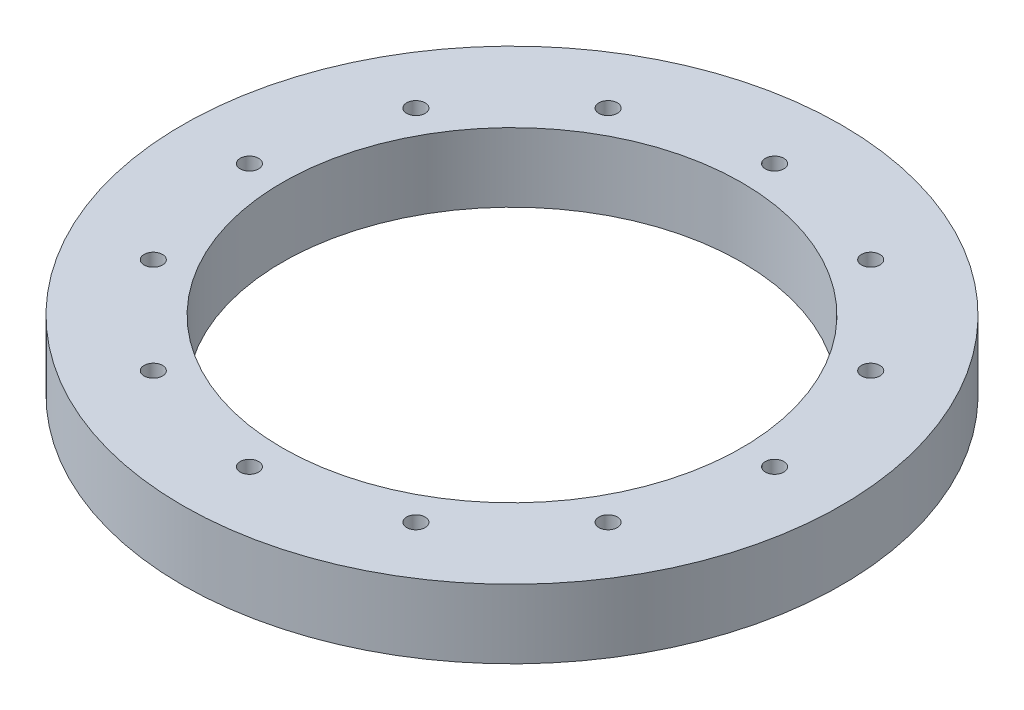
ISO-10303-21;
HEADER;
FILE_DESCRIPTION(('STEP AP214'),'2;1');
FILE_NAME('part.step','',(''),(''),'','','');
FILE_SCHEMA(('AUTOMOTIVE_DESIGN { 1 0 10303 214 1 1 1 1 }'));
ENDSEC;
DATA;
#1=APPLICATION_CONTEXT('core data for automotive mechanical design processes');
#2=APPLICATION_PROTOCOL_DEFINITION('international standard','automotive_design',2000,#1);
#3=PRODUCT_CONTEXT('',#1,'mechanical');
#4=PRODUCT('Part','Part','',(#3));
#5=PRODUCT_RELATED_PRODUCT_CATEGORY('part','',(#4));
#6=PRODUCT_DEFINITION_FORMATION('','',#4);
#7=PRODUCT_DEFINITION_CONTEXT('part definition',#1,'design');
#8=PRODUCT_DEFINITION('design','',#6,#7);
#9=PRODUCT_DEFINITION_SHAPE('','',#8);
#10=(LENGTH_UNIT() NAMED_UNIT(*) SI_UNIT(.MILLI.,.METRE.));
#11=(NAMED_UNIT(*) PLANE_ANGLE_UNIT() SI_UNIT($,.RADIAN.));
#12=(NAMED_UNIT(*) SI_UNIT($,.STERADIAN.) SOLID_ANGLE_UNIT());
#13=UNCERTAINTY_MEASURE_WITH_UNIT(LENGTH_MEASURE(1.E-05),#10,'distance_accuracy_value','');
#14=(GEOMETRIC_REPRESENTATION_CONTEXT(3) GLOBAL_UNCERTAINTY_ASSIGNED_CONTEXT((#13)) GLOBAL_UNIT_ASSIGNED_CONTEXT((#10,
#11,#12)) REPRESENTATION_CONTEXT('',''));
#15=CARTESIAN_POINT('',(0.,0.,0.));
#16=DIRECTION('',(0.,0.,1.));
#17=DIRECTION('',(1.,0.,0.));
#18=AXIS2_PLACEMENT_3D('',#15,#16,#17);
#19=CARTESIAN_POINT('',(0.,26.67,0.));
#20=DIRECTION('',(0.,1.,0.));
#21=DIRECTION('',(0.,0.,1.));
#22=AXIS2_PLACEMENT_3D('',#19,#20,#21);
#23=PLANE('',#22);
#24=CARTESIAN_POINT('',(-87.9881810244968,26.67,-50.7999999999962));
#25=DIRECTION('',(0.,1.,0.));
#26=DIRECTION('',(0.,0.,1.));
#27=AXIS2_PLACEMENT_3D('',#24,#25,#26);
#28=CIRCLE('',#27,3.56870000000436);
#29=CARTESIAN_POINT('',(-87.9881810244968,26.67,-47.2312999999918));
#30=VERTEX_POINT('',#29);
#31=EDGE_CURVE('E115',#30,#30,#28,.T.);
#32=ORIENTED_EDGE('',*,*,#31,.F.);
#33=EDGE_LOOP('',(#32));
#34=FACE_BOUND('',#33,.T.);
#35=CARTESIAN_POINT('',(-87.9881810244925,26.67,50.8000000000038));
#36=DIRECTION('',(0.,1.,0.));
#37=DIRECTION('',(0.,0.,1.));
#38=AXIS2_PLACEMENT_3D('',#35,#36,#37);
#39=CIRCLE('',#38,3.56870000000821);
#40=CARTESIAN_POINT('',(-87.9881810244925,26.67,54.368700000012));
#41=VERTEX_POINT('',#40);
#42=EDGE_CURVE('E103',#41,#41,#39,.T.);
#43=ORIENTED_EDGE('',*,*,#42,.F.);
#44=EDGE_LOOP('',(#43));
#45=FACE_BOUND('',#44,.T.);
#46=CARTESIAN_POINT('',(8.62560979994913E-12,26.67,101.6));
#47=DIRECTION('',(0.,1.,0.));
#48=DIRECTION('',(0.,0.,1.));
#49=AXIS2_PLACEMENT_3D('',#46,#47,#48);
#50=CIRCLE('',#49,3.56870000000893);
#51=CARTESIAN_POINT('',(8.62560979994913E-12,26.67,105.168700000009));
#52=VERTEX_POINT('',#51);
#53=EDGE_CURVE('E91',#52,#52,#50,.T.);
#54=ORIENTED_EDGE('',*,*,#53,.F.);
#55=EDGE_LOOP('',(#54));
#56=FACE_BOUND('',#55,.T.);
#57=CARTESIAN_POINT('',(87.9881810245054,26.67,50.7999999999963));
#58=DIRECTION('',(0.,1.,0.));
#59=DIRECTION('',(0.,0.,1.));
#60=AXIS2_PLACEMENT_3D('',#57,#58,#59);
#61=CIRCLE('',#60,3.56870000000556);
#62=CARTESIAN_POINT('',(87.9881810245054,26.67,54.3687000000018));
#63=VERTEX_POINT('',#62);
#64=EDGE_CURVE('E79',#63,#63,#61,.T.);
#65=ORIENTED_EDGE('',*,*,#64,.F.);
#66=EDGE_LOOP('',(#65));
#67=FACE_BOUND('',#66,.T.);
#68=CARTESIAN_POINT('',(87.9881810245011,26.67,-50.8000000000037));
#69=DIRECTION('',(0.,1.,0.));
#70=DIRECTION('',(0.,0.,1.));
#71=AXIS2_PLACEMENT_3D('',#68,#69,#70);
#72=CIRCLE('',#71,3.56870000000122);
#73=CARTESIAN_POINT('',(87.9881810245011,26.67,-47.2313000000025));
#74=VERTEX_POINT('',#73);
#75=EDGE_CURVE('E67',#74,#74,#72,.T.);
#76=ORIENTED_EDGE('',*,*,#75,.F.);
#77=EDGE_LOOP('',(#76));
#78=FACE_BOUND('',#77,.T.);
#79=CARTESIAN_POINT('',(0.,26.67,-101.6));
#80=DIRECTION('',(0.,1.,0.));
#81=DIRECTION('',(0.,0.,1.));
#82=AXIS2_PLACEMENT_3D('',#79,#80,#81);
#83=CIRCLE('',#82,3.5687);
#84=CARTESIAN_POINT('',(0.,26.67,-98.0313));
#85=VERTEX_POINT('',#84);
#86=EDGE_CURVE('E55',#85,#85,#83,.T.);
#87=ORIENTED_EDGE('',*,*,#86,.F.);
#88=EDGE_LOOP('',(#87));
#89=FACE_BOUND('',#88,.T.);
#90=CARTESIAN_POINT('',(0.,26.67,0.));
#91=DIRECTION('',(0.,1.,0.));
#92=DIRECTION('',(0.,0.,1.));
#93=AXIS2_PLACEMENT_3D('',#90,#91,#92);
#94=CIRCLE('',#93,127.508);
#95=CARTESIAN_POINT('',(0.,26.67,127.508));
#96=VERTEX_POINT('',#95);
#97=EDGE_CURVE('E10',#96,#96,#94,.T.);
#98=ORIENTED_EDGE('',*,*,#97,.T.);
#99=EDGE_LOOP('',(#98));
#100=FACE_BOUND('',#99,.T.);
#101=CARTESIAN_POINT('',(0.,26.67,0.));
#102=DIRECTION('',(0.,1.,0.));
#103=DIRECTION('',(0.,0.,1.));
#104=AXIS2_PLACEMENT_3D('',#101,#102,#103);
#105=CIRCLE('',#104,88.9);
#106=CARTESIAN_POINT('',(0.,26.67,88.9));
#107=VERTEX_POINT('',#106);
#108=EDGE_CURVE('E50',#107,#107,#105,.T.);
#109=ORIENTED_EDGE('',*,*,#108,.F.);
#110=EDGE_LOOP('',(#109));
#111=FACE_BOUND('',#110,.T.);
#112=CARTESIAN_POINT('',(50.8000000000001,26.67,-87.9881810244989));
#113=DIRECTION('',(0.,1.,0.));
#114=DIRECTION('',(0.,0.,1.));
#115=AXIS2_PLACEMENT_3D('',#112,#113,#114);
#116=CIRCLE('',#115,3.5687);
#117=CARTESIAN_POINT('',(50.8000000000001,26.67,-84.4194810244989));
#118=VERTEX_POINT('',#117);
#119=EDGE_CURVE('E61',#118,#118,#116,.T.);
#120=ORIENTED_EDGE('',*,*,#119,.F.);
#121=EDGE_LOOP('',(#120));
#122=FACE_BOUND('',#121,.T.);
#123=CARTESIAN_POINT('',(101.600000000004,26.67,-4.31280489997457E-12));
#124=DIRECTION('',(0.,1.,0.));
#125=DIRECTION('',(0.,0.,1.));
#126=AXIS2_PLACEMENT_3D('',#123,#124,#125);
#127=CIRCLE('',#126,3.56870000000321);
#128=CARTESIAN_POINT('',(101.600000000004,26.67,3.56869999999889));
#129=VERTEX_POINT('',#128);
#130=EDGE_CURVE('E73',#129,#129,#127,.T.);
#131=ORIENTED_EDGE('',*,*,#130,.F.);
#132=EDGE_LOOP('',(#131));
#133=FACE_BOUND('',#132,.T.);
#134=CARTESIAN_POINT('',(50.8000000000081,26.67,87.9881810244968));
#135=DIRECTION('',(0.,1.,0.));
#136=DIRECTION('',(0.,0.,1.));
#137=AXIS2_PLACEMENT_3D('',#134,#135,#136);
#138=CIRCLE('',#137,3.56870000000767);
#139=CARTESIAN_POINT('',(50.8000000000081,26.67,91.5568810245044));
#140=VERTEX_POINT('',#139);
#141=EDGE_CURVE('E85',#140,#140,#138,.T.);
#142=ORIENTED_EDGE('',*,*,#141,.F.);
#143=EDGE_LOOP('',(#142));
#144=FACE_BOUND('',#143,.T.);
#145=CARTESIAN_POINT('',(-50.7999999999919,26.67,87.9881810245011));
#146=DIRECTION('',(0.,1.,0.));
#147=DIRECTION('',(0.,0.,1.));
#148=AXIS2_PLACEMENT_3D('',#145,#146,#147);
#149=CIRCLE('',#148,3.56870000000915);
#150=CARTESIAN_POINT('',(-50.7999999999919,26.67,91.5568810245103));
#151=VERTEX_POINT('',#150);
#152=EDGE_CURVE('E97',#151,#151,#149,.T.);
#153=ORIENTED_EDGE('',*,*,#152,.F.);
#154=EDGE_LOOP('',(#153));
#155=FACE_BOUND('',#154,.T.);
#156=CARTESIAN_POINT('',(-101.599999999996,26.67,4.3252473114539E-12));
#157=DIRECTION('',(0.,1.,0.));
#158=DIRECTION('',(0.,0.,1.));
#159=AXIS2_PLACEMENT_3D('',#156,#157,#158);
#160=CIRCLE('',#159,3.56870000000642);
#161=CARTESIAN_POINT('',(-101.599999999996,26.67,3.56870000001074));
#162=VERTEX_POINT('',#161);
#163=EDGE_CURVE('E109',#162,#162,#160,.T.);
#164=ORIENTED_EDGE('',*,*,#163,.F.);
#165=EDGE_LOOP('',(#164));
#166=FACE_BOUND('',#165,.T.);
#167=CARTESIAN_POINT('',(-50.7999999999995,26.67,-87.9881810244968));
#168=DIRECTION('',(0.,1.,0.));
#169=DIRECTION('',(0.,0.,1.));
#170=AXIS2_PLACEMENT_3D('',#167,#168,#169);
#171=CIRCLE('',#170,3.56870000000249);
#172=CARTESIAN_POINT('',(-50.7999999999995,26.67,-84.4194810244943));
#173=VERTEX_POINT('',#172);
#174=EDGE_CURVE('E121',#173,#173,#171,.T.);
#175=ORIENTED_EDGE('',*,*,#174,.F.);
#176=EDGE_LOOP('',(#175));
#177=FACE_BOUND('',#176,.T.);
#178=ADVANCED_FACE('F39',(#34,#45,#56,#67,#78,#89,#100,#111,#122,#133,#144,#155,#166,#177),#23,.T.);
#179=CARTESIAN_POINT('',(0.,0.,0.));
#180=DIRECTION('',(0.,1.,0.));
#181=DIRECTION('',(0.,0.,1.));
#182=AXIS2_PLACEMENT_3D('',#179,#180,#181);
#183=PLANE('',#182);
#184=CARTESIAN_POINT('',(0.,0.,0.));
#185=DIRECTION('',(0.,1.,0.));
#186=DIRECTION('',(0.,0.,1.));
#187=AXIS2_PLACEMENT_3D('',#184,#185,#186);
#188=CIRCLE('',#187,127.508);
#189=CARTESIAN_POINT('',(0.,0.,127.508));
#190=VERTEX_POINT('',#189);
#191=EDGE_CURVE('E43',#190,#190,#188,.T.);
#192=ORIENTED_EDGE('',*,*,#191,.F.);
#193=EDGE_LOOP('',(#192));
#194=FACE_BOUND('',#193,.T.);
#195=CARTESIAN_POINT('',(0.,0.,0.));
#196=DIRECTION('',(0.,1.,0.));
#197=DIRECTION('',(0.,0.,1.));
#198=AXIS2_PLACEMENT_3D('',#195,#196,#197);
#199=CIRCLE('',#198,88.9);
#200=CARTESIAN_POINT('',(0.,0.,88.9));
#201=VERTEX_POINT('',#200);
#202=EDGE_CURVE('E52',#201,#201,#199,.T.);
#203=ORIENTED_EDGE('',*,*,#202,.T.);
#204=EDGE_LOOP('',(#203));
#205=FACE_BOUND('',#204,.T.);
#206=CARTESIAN_POINT('',(0.,0.,-101.6));
#207=DIRECTION('',(0.,1.,0.));
#208=DIRECTION('',(0.,0.,1.));
#209=AXIS2_PLACEMENT_3D('',#206,#207,#208);
#210=CIRCLE('',#209,3.5687);
#211=CARTESIAN_POINT('',(0.,0.,-98.0313));
#212=VERTEX_POINT('',#211);
#213=EDGE_CURVE('E58',#212,#212,#210,.T.);
#214=ORIENTED_EDGE('',*,*,#213,.T.);
#215=EDGE_LOOP('',(#214));
#216=FACE_BOUND('',#215,.T.);
#217=CARTESIAN_POINT('',(50.8000000000001,0.,-87.9881810244989));
#218=DIRECTION('',(0.,1.,0.));
#219=DIRECTION('',(0.,0.,1.));
#220=AXIS2_PLACEMENT_3D('',#217,#218,#219);
#221=CIRCLE('',#220,3.5687);
#222=CARTESIAN_POINT('',(50.8000000000001,0.,-84.4194810244989));
#223=VERTEX_POINT('',#222);
#224=EDGE_CURVE('E64',#223,#223,#221,.T.);
#225=ORIENTED_EDGE('',*,*,#224,.T.);
#226=EDGE_LOOP('',(#225));
#227=FACE_BOUND('',#226,.T.);
#228=CARTESIAN_POINT('',(87.9881810245011,0.,-50.8000000000037));
#229=DIRECTION('',(0.,1.,0.));
#230=DIRECTION('',(0.,0.,1.));
#231=AXIS2_PLACEMENT_3D('',#228,#229,#230);
#232=CIRCLE('',#231,3.56870000000122);
#233=CARTESIAN_POINT('',(87.9881810245011,0.,-47.2313000000025));
#234=VERTEX_POINT('',#233);
#235=EDGE_CURVE('E70',#234,#234,#232,.T.);
#236=ORIENTED_EDGE('',*,*,#235,.T.);
#237=EDGE_LOOP('',(#236));
#238=FACE_BOUND('',#237,.T.);
#239=CARTESIAN_POINT('',(101.600000000004,0.,-4.31280489997457E-12));
#240=DIRECTION('',(0.,1.,0.));
#241=DIRECTION('',(0.,0.,1.));
#242=AXIS2_PLACEMENT_3D('',#239,#240,#241);
#243=CIRCLE('',#242,3.56870000000321);
#244=CARTESIAN_POINT('',(101.600000000004,0.,3.56869999999889));
#245=VERTEX_POINT('',#244);
#246=EDGE_CURVE('E76',#245,#245,#243,.T.);
#247=ORIENTED_EDGE('',*,*,#246,.T.);
#248=EDGE_LOOP('',(#247));
#249=FACE_BOUND('',#248,.T.);
#250=CARTESIAN_POINT('',(87.9881810245054,0.,50.7999999999963));
#251=DIRECTION('',(0.,1.,0.));
#252=DIRECTION('',(0.,0.,1.));
#253=AXIS2_PLACEMENT_3D('',#250,#251,#252);
#254=CIRCLE('',#253,3.56870000000556);
#255=CARTESIAN_POINT('',(87.9881810245054,0.,54.3687000000018));
#256=VERTEX_POINT('',#255);
#257=EDGE_CURVE('E82',#256,#256,#254,.T.);
#258=ORIENTED_EDGE('',*,*,#257,.T.);
#259=EDGE_LOOP('',(#258));
#260=FACE_BOUND('',#259,.T.);
#261=CARTESIAN_POINT('',(50.8000000000081,0.,87.9881810244968));
#262=DIRECTION('',(0.,1.,0.));
#263=DIRECTION('',(0.,0.,1.));
#264=AXIS2_PLACEMENT_3D('',#261,#262,#263);
#265=CIRCLE('',#264,3.56870000000767);
#266=CARTESIAN_POINT('',(50.8000000000081,0.,91.5568810245044));
#267=VERTEX_POINT('',#266);
#268=EDGE_CURVE('E88',#267,#267,#265,.T.);
#269=ORIENTED_EDGE('',*,*,#268,.T.);
#270=EDGE_LOOP('',(#269));
#271=FACE_BOUND('',#270,.T.);
#272=CARTESIAN_POINT('',(8.62560979994913E-12,0.,101.6));
#273=DIRECTION('',(0.,1.,0.));
#274=DIRECTION('',(0.,0.,1.));
#275=AXIS2_PLACEMENT_3D('',#272,#273,#274);
#276=CIRCLE('',#275,3.56870000000893);
#277=CARTESIAN_POINT('',(8.62560979994913E-12,0.,105.168700000009));
#278=VERTEX_POINT('',#277);
#279=EDGE_CURVE('E94',#278,#278,#276,.T.);
#280=ORIENTED_EDGE('',*,*,#279,.T.);
#281=EDGE_LOOP('',(#280));
#282=FACE_BOUND('',#281,.T.);
#283=CARTESIAN_POINT('',(-50.7999999999919,0.,87.9881810245011));
#284=DIRECTION('',(0.,1.,0.));
#285=DIRECTION('',(0.,0.,1.));
#286=AXIS2_PLACEMENT_3D('',#283,#284,#285);
#287=CIRCLE('',#286,3.56870000000915);
#288=CARTESIAN_POINT('',(-50.7999999999919,0.,91.5568810245103));
#289=VERTEX_POINT('',#288);
#290=EDGE_CURVE('E100',#289,#289,#287,.T.);
#291=ORIENTED_EDGE('',*,*,#290,.T.);
#292=EDGE_LOOP('',(#291));
#293=FACE_BOUND('',#292,.T.);
#294=CARTESIAN_POINT('',(-87.9881810244925,0.,50.8000000000038));
#295=DIRECTION('',(0.,1.,0.));
#296=DIRECTION('',(0.,0.,1.));
#297=AXIS2_PLACEMENT_3D('',#294,#295,#296);
#298=CIRCLE('',#297,3.56870000000821);
#299=CARTESIAN_POINT('',(-87.9881810244925,0.,54.368700000012));
#300=VERTEX_POINT('',#299);
#301=EDGE_CURVE('E106',#300,#300,#298,.T.);
#302=ORIENTED_EDGE('',*,*,#301,.T.);
#303=EDGE_LOOP('',(#302));
#304=FACE_BOUND('',#303,.T.);
#305=CARTESIAN_POINT('',(-101.599999999996,0.,4.3252473114539E-12));
#306=DIRECTION('',(0.,1.,0.));
#307=DIRECTION('',(0.,0.,1.));
#308=AXIS2_PLACEMENT_3D('',#305,#306,#307);
#309=CIRCLE('',#308,3.56870000000642);
#310=CARTESIAN_POINT('',(-101.599999999996,0.,3.56870000001074));
#311=VERTEX_POINT('',#310);
#312=EDGE_CURVE('E112',#311,#311,#309,.T.);
#313=ORIENTED_EDGE('',*,*,#312,.T.);
#314=EDGE_LOOP('',(#313));
#315=FACE_BOUND('',#314,.T.);
#316=CARTESIAN_POINT('',(-87.9881810244968,0.,-50.7999999999962));
#317=DIRECTION('',(0.,1.,0.));
#318=DIRECTION('',(0.,0.,1.));
#319=AXIS2_PLACEMENT_3D('',#316,#317,#318);
#320=CIRCLE('',#319,3.56870000000436);
#321=CARTESIAN_POINT('',(-87.9881810244968,0.,-47.2312999999918));
#322=VERTEX_POINT('',#321);
#323=EDGE_CURVE('E118',#322,#322,#320,.T.);
#324=ORIENTED_EDGE('',*,*,#323,.T.);
#325=EDGE_LOOP('',(#324));
#326=FACE_BOUND('',#325,.T.);
#327=CARTESIAN_POINT('',(-50.7999999999995,0.,-87.9881810244968));
#328=DIRECTION('',(0.,1.,0.));
#329=DIRECTION('',(0.,0.,1.));
#330=AXIS2_PLACEMENT_3D('',#327,#328,#329);
#331=CIRCLE('',#330,3.56870000000249);
#332=CARTESIAN_POINT('',(-50.7999999999995,0.,-84.4194810244943));
#333=VERTEX_POINT('',#332);
#334=EDGE_CURVE('E124',#333,#333,#331,.T.);
#335=ORIENTED_EDGE('',*,*,#334,.T.);
#336=EDGE_LOOP('',(#335));
#337=FACE_BOUND('',#336,.T.);
#338=ADVANCED_FACE('F134',(#194,#205,#216,#227,#238,#249,#260,#271,#282,#293,#304,#315,#326,
#337),#183,.F.);
#339=CARTESIAN_POINT('',(0.,26.67,0.));
#340=DIRECTION('',(0.,-1.,0.));
#341=DIRECTION('',(0.,0.,-1.));
#342=AXIS2_PLACEMENT_3D('',#339,#340,#341);
#343=CYLINDRICAL_SURFACE('',#342,127.508);
#344=ORIENTED_EDGE('',*,*,#97,.F.);
#345=EDGE_LOOP('',(#344));
#346=FACE_BOUND('',#345,.T.);
#347=ORIENTED_EDGE('',*,*,#191,.T.);
#348=EDGE_LOOP('',(#347));
#349=FACE_BOUND('',#348,.T.);
#350=ADVANCED_FACE('F41',(#346,#349),#343,.T.);
#351=CARTESIAN_POINT('',(0.,26.67,0.));
#352=DIRECTION('',(0.,-1.,0.));
#353=DIRECTION('',(0.,0.,-1.));
#354=AXIS2_PLACEMENT_3D('',#351,#352,#353);
#355=CYLINDRICAL_SURFACE('',#354,88.9);
#356=ORIENTED_EDGE('',*,*,#108,.T.);
#357=EDGE_LOOP('',(#356));
#358=FACE_BOUND('',#357,.T.);
#359=ORIENTED_EDGE('',*,*,#202,.F.);
#360=EDGE_LOOP('',(#359));
#361=FACE_BOUND('',#360,.T.);
#362=ADVANCED_FACE('F144',(#358,#361),#355,.F.);
#363=CARTESIAN_POINT('',(0.,26.67,-101.6));
#364=DIRECTION('',(0.,-1.,0.));
#365=DIRECTION('',(0.,0.,-1.));
#366=AXIS2_PLACEMENT_3D('',#363,#364,#365);
#367=CYLINDRICAL_SURFACE('',#366,3.5687);
#368=ORIENTED_EDGE('',*,*,#86,.T.);
#369=EDGE_LOOP('',(#368));
#370=FACE_BOUND('',#369,.T.);
#371=ORIENTED_EDGE('',*,*,#213,.F.);
#372=EDGE_LOOP('',(#371));
#373=FACE_BOUND('',#372,.T.);
#374=ADVANCED_FACE('F147',(#370,#373),#367,.F.);
#375=CARTESIAN_POINT('',(50.8000000000001,26.67,-87.9881810244989));
#376=DIRECTION('',(0.,-1.,0.));
#377=DIRECTION('',(0.,0.,-1.));
#378=AXIS2_PLACEMENT_3D('',#375,#376,#377);
#379=CYLINDRICAL_SURFACE('',#378,3.5687);
#380=ORIENTED_EDGE('',*,*,#119,.T.);
#381=EDGE_LOOP('',(#380));
#382=FACE_BOUND('',#381,.T.);
#383=ORIENTED_EDGE('',*,*,#224,.F.);
#384=EDGE_LOOP('',(#383));
#385=FACE_BOUND('',#384,.T.);
#386=ADVANCED_FACE('F151',(#382,#385),#379,.F.);
#387=CARTESIAN_POINT('',(87.9881810245011,26.67,-50.8000000000037));
#388=DIRECTION('',(0.,-1.,0.));
#389=DIRECTION('',(0.,0.,-1.));
#390=AXIS2_PLACEMENT_3D('',#387,#388,#389);
#391=CYLINDRICAL_SURFACE('',#390,3.56870000000122);
#392=ORIENTED_EDGE('',*,*,#75,.T.);
#393=EDGE_LOOP('',(#392));
#394=FACE_BOUND('',#393,.T.);
#395=ORIENTED_EDGE('',*,*,#235,.F.);
#396=EDGE_LOOP('',(#395));
#397=FACE_BOUND('',#396,.T.);
#398=ADVANCED_FACE('F155',(#394,#397),#391,.F.);
#399=CARTESIAN_POINT('',(101.600000000004,26.67,-4.31280489997457E-12));
#400=DIRECTION('',(0.,-1.,0.));
#401=DIRECTION('',(0.,0.,-1.));
#402=AXIS2_PLACEMENT_3D('',#399,#400,#401);
#403=CYLINDRICAL_SURFACE('',#402,3.56870000000321);
#404=ORIENTED_EDGE('',*,*,#130,.T.);
#405=EDGE_LOOP('',(#404));
#406=FACE_BOUND('',#405,.T.);
#407=ORIENTED_EDGE('',*,*,#246,.F.);
#408=EDGE_LOOP('',(#407));
#409=FACE_BOUND('',#408,.T.);
#410=ADVANCED_FACE('F159',(#406,#409),#403,.F.);
#411=CARTESIAN_POINT('',(87.9881810245054,26.67,50.7999999999963));
#412=DIRECTION('',(0.,-1.,0.));
#413=DIRECTION('',(0.,0.,-1.));
#414=AXIS2_PLACEMENT_3D('',#411,#412,#413);
#415=CYLINDRICAL_SURFACE('',#414,3.56870000000556);
#416=ORIENTED_EDGE('',*,*,#64,.T.);
#417=EDGE_LOOP('',(#416));
#418=FACE_BOUND('',#417,.T.);
#419=ORIENTED_EDGE('',*,*,#257,.F.);
#420=EDGE_LOOP('',(#419));
#421=FACE_BOUND('',#420,.T.);
#422=ADVANCED_FACE('F163',(#418,#421),#415,.F.);
#423=CARTESIAN_POINT('',(50.8000000000081,26.67,87.9881810244968));
#424=DIRECTION('',(0.,-1.,0.));
#425=DIRECTION('',(0.,0.,-1.));
#426=AXIS2_PLACEMENT_3D('',#423,#424,#425);
#427=CYLINDRICAL_SURFACE('',#426,3.56870000000767);
#428=ORIENTED_EDGE('',*,*,#141,.T.);
#429=EDGE_LOOP('',(#428));
#430=FACE_BOUND('',#429,.T.);
#431=ORIENTED_EDGE('',*,*,#268,.F.);
#432=EDGE_LOOP('',(#431));
#433=FACE_BOUND('',#432,.T.);
#434=ADVANCED_FACE('F167',(#430,#433),#427,.F.);
#435=CARTESIAN_POINT('',(8.62560979994913E-12,26.67,101.6));
#436=DIRECTION('',(0.,-1.,0.));
#437=DIRECTION('',(0.,0.,-1.));
#438=AXIS2_PLACEMENT_3D('',#435,#436,#437);
#439=CYLINDRICAL_SURFACE('',#438,3.56870000000893);
#440=ORIENTED_EDGE('',*,*,#53,.T.);
#441=EDGE_LOOP('',(#440));
#442=FACE_BOUND('',#441,.T.);
#443=ORIENTED_EDGE('',*,*,#279,.F.);
#444=EDGE_LOOP('',(#443));
#445=FACE_BOUND('',#444,.T.);
#446=ADVANCED_FACE('F171',(#442,#445),#439,.F.);
#447=CARTESIAN_POINT('',(-50.7999999999919,26.67,87.9881810245011));
#448=DIRECTION('',(0.,-1.,0.));
#449=DIRECTION('',(0.,0.,-1.));
#450=AXIS2_PLACEMENT_3D('',#447,#448,#449);
#451=CYLINDRICAL_SURFACE('',#450,3.56870000000915);
#452=ORIENTED_EDGE('',*,*,#152,.T.);
#453=EDGE_LOOP('',(#452));
#454=FACE_BOUND('',#453,.T.);
#455=ORIENTED_EDGE('',*,*,#290,.F.);
#456=EDGE_LOOP('',(#455));
#457=FACE_BOUND('',#456,.T.);
#458=ADVANCED_FACE('F175',(#454,#457),#451,.F.);
#459=CARTESIAN_POINT('',(-87.9881810244925,26.67,50.8000000000038));
#460=DIRECTION('',(0.,-1.,0.));
#461=DIRECTION('',(0.,0.,-1.));
#462=AXIS2_PLACEMENT_3D('',#459,#460,#461);
#463=CYLINDRICAL_SURFACE('',#462,3.56870000000821);
#464=ORIENTED_EDGE('',*,*,#42,.T.);
#465=EDGE_LOOP('',(#464));
#466=FACE_BOUND('',#465,.T.);
#467=ORIENTED_EDGE('',*,*,#301,.F.);
#468=EDGE_LOOP('',(#467));
#469=FACE_BOUND('',#468,.T.);
#470=ADVANCED_FACE('F179',(#466,#469),#463,.F.);
#471=CARTESIAN_POINT('',(-101.599999999996,26.67,4.3252473114539E-12));
#472=DIRECTION('',(0.,-1.,0.));
#473=DIRECTION('',(0.,0.,-1.));
#474=AXIS2_PLACEMENT_3D('',#471,#472,#473);
#475=CYLINDRICAL_SURFACE('',#474,3.56870000000642);
#476=ORIENTED_EDGE('',*,*,#163,.T.);
#477=EDGE_LOOP('',(#476));
#478=FACE_BOUND('',#477,.T.);
#479=ORIENTED_EDGE('',*,*,#312,.F.);
#480=EDGE_LOOP('',(#479));
#481=FACE_BOUND('',#480,.T.);
#482=ADVANCED_FACE('F183',(#478,#481),#475,.F.);
#483=CARTESIAN_POINT('',(-87.9881810244968,26.67,-50.7999999999962));
#484=DIRECTION('',(0.,-1.,0.));
#485=DIRECTION('',(0.,0.,-1.));
#486=AXIS2_PLACEMENT_3D('',#483,#484,#485);
#487=CYLINDRICAL_SURFACE('',#486,3.56870000000436);
#488=ORIENTED_EDGE('',*,*,#31,.T.);
#489=EDGE_LOOP('',(#488));
#490=FACE_BOUND('',#489,.T.);
#491=ORIENTED_EDGE('',*,*,#323,.F.);
#492=EDGE_LOOP('',(#491));
#493=FACE_BOUND('',#492,.T.);
#494=ADVANCED_FACE('F187',(#490,#493),#487,.F.);
#495=CARTESIAN_POINT('',(-50.7999999999995,26.67,-87.9881810244968));
#496=DIRECTION('',(0.,-1.,0.));
#497=DIRECTION('',(0.,0.,-1.));
#498=AXIS2_PLACEMENT_3D('',#495,#496,#497);
#499=CYLINDRICAL_SURFACE('',#498,3.56870000000249);
#500=ORIENTED_EDGE('',*,*,#174,.T.);
#501=EDGE_LOOP('',(#500));
#502=FACE_BOUND('',#501,.T.);
#503=ORIENTED_EDGE('',*,*,#334,.F.);
#504=EDGE_LOOP('',(#503));
#505=FACE_BOUND('',#504,.T.);
#506=ADVANCED_FACE('F130',(#502,#505),#499,.F.);
#507=CLOSED_SHELL('',(#178,#338,#350,#362,#374,#386,#398,#410,#422,#434,#446,#458,#470,#482,
#494,#506));
#508=MANIFOLD_SOLID_BREP('B2',#507);
#509=ADVANCED_BREP_SHAPE_REPRESENTATION('',(#18,#508),#14);
#510=SHAPE_DEFINITION_REPRESENTATION(#9,#509);
ENDSEC;
END-ISO-10303-21;
